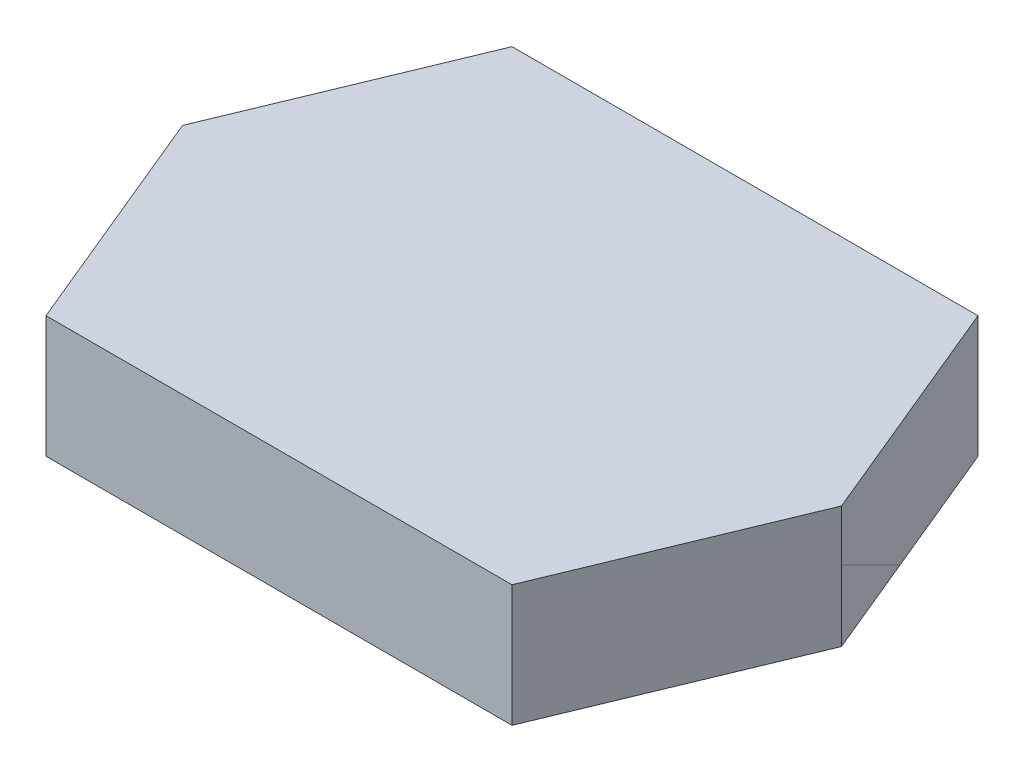
ISO-10303-21;
HEADER;
FILE_DESCRIPTION(('STEP AP214'),'2;1');
FILE_NAME('part.step','',(''),(''),'','','');
FILE_SCHEMA(('AUTOMOTIVE_DESIGN { 1 0 10303 214 1 1 1 1 }'));
ENDSEC;
DATA;
#1=APPLICATION_CONTEXT('core data for automotive mechanical design processes');
#2=APPLICATION_PROTOCOL_DEFINITION('international standard','automotive_design',2000,#1);
#3=PRODUCT_CONTEXT('',#1,'mechanical');
#4=PRODUCT('Part','Part','',(#3));
#5=PRODUCT_RELATED_PRODUCT_CATEGORY('part','',(#4));
#6=PRODUCT_DEFINITION_FORMATION('','',#4);
#7=PRODUCT_DEFINITION_CONTEXT('part definition',#1,'design');
#8=PRODUCT_DEFINITION('design','',#6,#7);
#9=PRODUCT_DEFINITION_SHAPE('','',#8);
#10=(LENGTH_UNIT() NAMED_UNIT(*) SI_UNIT(.MILLI.,.METRE.));
#11=(NAMED_UNIT(*) PLANE_ANGLE_UNIT() SI_UNIT($,.RADIAN.));
#12=(NAMED_UNIT(*) SI_UNIT($,.STERADIAN.) SOLID_ANGLE_UNIT());
#13=UNCERTAINTY_MEASURE_WITH_UNIT(LENGTH_MEASURE(1.E-05),#10,'distance_accuracy_value','');
#14=(GEOMETRIC_REPRESENTATION_CONTEXT(3) GLOBAL_UNCERTAINTY_ASSIGNED_CONTEXT((#13)) GLOBAL_UNIT_ASSIGNED_CONTEXT((#10,
#11,#12)) REPRESENTATION_CONTEXT('',''));
#15=CARTESIAN_POINT('',(0.,0.,0.));
#16=DIRECTION('',(0.,0.,1.));
#17=DIRECTION('',(1.,0.,0.));
#18=AXIS2_PLACEMENT_3D('',#15,#16,#17);
#19=CARTESIAN_POINT('',(19.1341716182545,10.,-19.1341716182545));
#20=DIRECTION('',(0.,0.,1.));
#21=DIRECTION('',(1.,0.,0.));
#22=AXIS2_PLACEMENT_3D('',#19,#20,#21);
#23=PLANE('',#22);
#24=DIRECTION('',(-1.,0.,0.));
#25=VECTOR('',#24,1.);
#26=CARTESIAN_POINT('',(19.1341716182545,0.,-19.1341716182545));
#27=LINE('',#26,#25);
#28=CARTESIAN_POINT('',(19.1341716182545,0.,-19.1341716182545));
#29=VERTEX_POINT('',#28);
#30=CARTESIAN_POINT('',(-19.1341716182545,0.,-19.1341716182545));
#31=VERTEX_POINT('',#30);
#32=EDGE_CURVE('E134',#29,#31,#27,.T.);
#33=ORIENTED_EDGE('',*,*,#32,.T.);
#34=DIRECTION('',(0.,-1.,0.));
#35=VECTOR('',#34,1.);
#36=CARTESIAN_POINT('',(-19.1341716182545,10.,-19.1341716182545));
#37=LINE('',#36,#35);
#38=CARTESIAN_POINT('',(-19.1341716182545,10.,-19.1341716182545));
#39=VERTEX_POINT('',#38);
#40=EDGE_CURVE('E12',#39,#31,#37,.T.);
#41=ORIENTED_EDGE('',*,*,#40,.F.);
#42=DIRECTION('',(-1.,0.,0.));
#43=VECTOR('',#42,1.);
#44=CARTESIAN_POINT('',(19.1341716182545,10.,-19.1341716182545));
#45=LINE('',#44,#43);
#46=CARTESIAN_POINT('',(19.1341716182545,10.,-19.1341716182545));
#47=VERTEX_POINT('',#46);
#48=EDGE_CURVE('E145',#47,#39,#45,.T.);
#49=ORIENTED_EDGE('',*,*,#48,.F.);
#50=DIRECTION('',(0.,-1.,0.));
#51=VECTOR('',#50,1.);
#52=CARTESIAN_POINT('',(19.1341716182545,10.,-19.1341716182545));
#53=LINE('',#52,#51);
#54=EDGE_CURVE('E130',#47,#29,#53,.T.);
#55=ORIENTED_EDGE('',*,*,#54,.T.);
#56=EDGE_LOOP('',(#33,#41,#49,#55));
#57=FACE_BOUND('',#56,.T.);
#58=ADVANCED_FACE('F49',(#57),#23,.F.);
#59=CARTESIAN_POINT('',(-19.1341716182545,10.,-19.1341716182545));
#60=DIRECTION('',(0.923879532511287,0.,0.38268343236509));
#61=DIRECTION('',(0.38268343236509,0.,-0.923879532511287));
#62=AXIS2_PLACEMENT_3D('',#59,#60,#61);
#63=PLANE('',#62);
#64=DIRECTION('',(-0.38268343236509,0.,0.923879532511286));
#65=VECTOR('',#64,1.);
#66=CARTESIAN_POINT('',(-19.1341716182545,0.,-19.1341716182545));
#67=LINE('',#66,#65);
#68=CARTESIAN_POINT('',(-27.0598050073098,0.,0.));
#69=VERTEX_POINT('',#68);
#70=EDGE_CURVE('E137',#31,#69,#67,.T.);
#71=ORIENTED_EDGE('',*,*,#70,.T.);
#72=DIRECTION('',(0.,-1.,0.));
#73=VECTOR('',#72,1.);
#74=CARTESIAN_POINT('',(-27.0598050073098,10.,0.));
#75=LINE('',#74,#73);
#76=CARTESIAN_POINT('',(-27.0598050073098,10.,0.));
#77=VERTEX_POINT('',#76);
#78=EDGE_CURVE('E57',#77,#69,#75,.T.);
#79=ORIENTED_EDGE('',*,*,#78,.F.);
#80=DIRECTION('',(-0.38268343236509,0.,0.923879532511286));
#81=VECTOR('',#80,1.);
#82=CARTESIAN_POINT('',(-19.1341716182545,10.,-19.1341716182545));
#83=LINE('',#82,#81);
#84=EDGE_CURVE('E99',#39,#77,#83,.T.);
#85=ORIENTED_EDGE('',*,*,#84,.F.);
#86=ORIENTED_EDGE('',*,*,#40,.T.);
#87=EDGE_LOOP('',(#71,#79,#85,#86));
#88=FACE_BOUND('',#87,.T.);
#89=ADVANCED_FACE('F154',(#88),#63,.F.);
#90=CARTESIAN_POINT('',(-27.0598050073098,10.,0.));
#91=DIRECTION('',(0.923879532511287,0.,-0.38268343236509));
#92=DIRECTION('',(-0.38268343236509,0.,-0.923879532511287));
#93=AXIS2_PLACEMENT_3D('',#90,#91,#92);
#94=PLANE('',#93);
#95=DIRECTION('',(0.38268343236509,0.,0.923879532511287));
#96=VECTOR('',#95,1.);
#97=CARTESIAN_POINT('',(-27.0598050073098,0.,0.));
#98=LINE('',#97,#96);
#99=CARTESIAN_POINT('',(-19.1341716182545,0.,19.1341716182545));
#100=VERTEX_POINT('',#99);
#101=EDGE_CURVE('E139',#69,#100,#98,.T.);
#102=ORIENTED_EDGE('',*,*,#101,.T.);
#103=DIRECTION('',(0.,-1.,0.));
#104=VECTOR('',#103,1.);
#105=CARTESIAN_POINT('',(-19.1341716182545,10.,19.1341716182545));
#106=LINE('',#105,#104);
#107=CARTESIAN_POINT('',(-19.1341716182545,10.,19.1341716182545));
#108=VERTEX_POINT('',#107);
#109=EDGE_CURVE('E125',#108,#100,#106,.T.);
#110=ORIENTED_EDGE('',*,*,#109,.F.);
#111=DIRECTION('',(0.38268343236509,0.,0.923879532511287));
#112=VECTOR('',#111,1.);
#113=CARTESIAN_POINT('',(-27.0598050073098,10.,0.));
#114=LINE('',#113,#112);
#115=EDGE_CURVE('E113',#77,#108,#114,.T.);
#116=ORIENTED_EDGE('',*,*,#115,.F.);
#117=ORIENTED_EDGE('',*,*,#78,.T.);
#118=EDGE_LOOP('',(#102,#110,#116,#117));
#119=FACE_BOUND('',#118,.T.);
#120=ADVANCED_FACE('F151',(#119),#94,.F.);
#121=CARTESIAN_POINT('',(-19.1341716182545,10.,19.1341716182545));
#122=DIRECTION('',(0.,0.,-1.));
#123=DIRECTION('',(-1.,0.,0.));
#124=AXIS2_PLACEMENT_3D('',#121,#122,#123);
#125=PLANE('',#124);
#126=DIRECTION('',(1.,0.,0.));
#127=VECTOR('',#126,1.);
#128=CARTESIAN_POINT('',(-19.1341716182545,0.,19.1341716182545));
#129=LINE('',#128,#127);
#130=CARTESIAN_POINT('',(19.1341716182545,0.,19.1341716182545));
#131=VERTEX_POINT('',#130);
#132=EDGE_CURVE('E122',#100,#131,#129,.T.);
#133=ORIENTED_EDGE('',*,*,#132,.T.);
#134=DIRECTION('',(0.,-1.,0.));
#135=VECTOR('',#134,1.);
#136=CARTESIAN_POINT('',(19.1341716182545,10.,19.1341716182545));
#137=LINE('',#136,#135);
#138=CARTESIAN_POINT('',(19.1341716182545,10.,19.1341716182545));
#139=VERTEX_POINT('',#138);
#140=EDGE_CURVE('E119',#139,#131,#137,.T.);
#141=ORIENTED_EDGE('',*,*,#140,.F.);
#142=DIRECTION('',(1.,0.,0.));
#143=VECTOR('',#142,1.);
#144=CARTESIAN_POINT('',(-19.1341716182545,10.,19.1341716182545));
#145=LINE('',#144,#143);
#146=EDGE_CURVE('E106',#108,#139,#145,.T.);
#147=ORIENTED_EDGE('',*,*,#146,.F.);
#148=ORIENTED_EDGE('',*,*,#109,.T.);
#149=EDGE_LOOP('',(#133,#141,#147,#148));
#150=FACE_BOUND('',#149,.T.);
#151=ADVANCED_FACE('F120',(#150),#125,.F.);
#152=CARTESIAN_POINT('',(19.1341716182545,10.,19.1341716182545));
#153=DIRECTION('',(-0.923879532511287,0.,-0.382683432365091));
#154=DIRECTION('',(-0.382683432365091,0.,0.923879532511287));
#155=AXIS2_PLACEMENT_3D('',#152,#153,#154);
#156=PLANE('',#155);
#157=DIRECTION('',(0.382683432365091,0.,-0.923879532511287));
#158=VECTOR('',#157,1.);
#159=CARTESIAN_POINT('',(19.1341716182545,0.,19.1341716182545));
#160=LINE('',#159,#158);
#161=CARTESIAN_POINT('',(27.0598050073099,0.,0.));
#162=VERTEX_POINT('',#161);
#163=EDGE_CURVE('E142',#131,#162,#160,.T.);
#164=ORIENTED_EDGE('',*,*,#163,.T.);
#165=DIRECTION('',(0.,-1.,0.));
#166=VECTOR('',#165,1.);
#167=CARTESIAN_POINT('',(27.0598050073099,10.,0.));
#168=LINE('',#167,#166);
#169=CARTESIAN_POINT('',(27.0598050073099,10.,0.));
#170=VERTEX_POINT('',#169);
#171=EDGE_CURVE('E126',#170,#162,#168,.T.);
#172=ORIENTED_EDGE('',*,*,#171,.F.);
#173=DIRECTION('',(0.382683432365091,0.,-0.923879532511287));
#174=VECTOR('',#173,1.);
#175=CARTESIAN_POINT('',(19.1341716182545,10.,19.1341716182545));
#176=LINE('',#175,#174);
#177=EDGE_CURVE('E110',#139,#170,#176,.T.);
#178=ORIENTED_EDGE('',*,*,#177,.F.);
#179=ORIENTED_EDGE('',*,*,#140,.T.);
#180=EDGE_LOOP('',(#164,#172,#178,#179));
#181=FACE_BOUND('',#180,.T.);
#182=ADVANCED_FACE('F128',(#181),#156,.F.);
#183=CARTESIAN_POINT('',(23.0969883127822,10.,-9.56708580912727));
#184=DIRECTION('',(-0.923879532511287,0.,0.382683432365091));
#185=DIRECTION('',(0.382683432365091,0.,0.923879532511287));
#186=AXIS2_PLACEMENT_3D('',#183,#184,#185);
#187=PLANE('',#186);
#188=DIRECTION('',(-0.382683432365091,0.,-0.923879532511286));
#189=VECTOR('',#188,1.);
#190=CARTESIAN_POINT('',(23.0969883127822,0.,-9.56708580912727));
#191=LINE('',#190,#189);
#192=EDGE_CURVE('E88',#162,#29,#191,.T.);
#193=ORIENTED_EDGE('',*,*,#192,.T.);
#194=ORIENTED_EDGE('',*,*,#54,.F.);
#195=DIRECTION('',(0.38268343236509,0.,0.923879532511286));
#196=VECTOR('',#195,1.);
#197=CARTESIAN_POINT('',(23.0969883127822,10.,-9.56708580912727));
#198=LINE('',#197,#196);
#199=EDGE_CURVE('E65',#47,#170,#198,.T.);
#200=ORIENTED_EDGE('',*,*,#199,.T.);
#201=ORIENTED_EDGE('',*,*,#171,.T.);
#202=EDGE_LOOP('',(#193,#194,#200,#201));
#203=FACE_BOUND('',#202,.T.);
#204=ADVANCED_FACE('F157',(#203),#187,.F.);
#205=CARTESIAN_POINT('',(0.,10.,0.));
#206=DIRECTION('',(0.,1.,0.));
#207=DIRECTION('',(0.,0.,1.));
#208=AXIS2_PLACEMENT_3D('',#205,#206,#207);
#209=PLANE('',#208);
#210=ORIENTED_EDGE('',*,*,#48,.T.);
#211=ORIENTED_EDGE('',*,*,#84,.T.);
#212=ORIENTED_EDGE('',*,*,#115,.T.);
#213=ORIENTED_EDGE('',*,*,#146,.T.);
#214=ORIENTED_EDGE('',*,*,#177,.T.);
#215=ORIENTED_EDGE('',*,*,#199,.F.);
#216=EDGE_LOOP('',(#210,#211,#212,#213,#214,#215));
#217=FACE_BOUND('',#216,.T.);
#218=ADVANCED_FACE('F108',(#217),#209,.T.);
#219=CARTESIAN_POINT('',(0.,0.,0.));
#220=DIRECTION('',(0.,1.,0.));
#221=DIRECTION('',(0.,0.,1.));
#222=AXIS2_PLACEMENT_3D('',#219,#220,#221);
#223=PLANE('',#222);
#224=ORIENTED_EDGE('',*,*,#32,.F.);
#225=ORIENTED_EDGE('',*,*,#192,.F.);
#226=ORIENTED_EDGE('',*,*,#163,.F.);
#227=ORIENTED_EDGE('',*,*,#132,.F.);
#228=ORIENTED_EDGE('',*,*,#101,.F.);
#229=ORIENTED_EDGE('',*,*,#70,.F.);
#230=EDGE_LOOP('',(#224,#225,#226,#227,#228,#229));
#231=FACE_BOUND('',#230,.T.);
#232=ADVANCED_FACE('F152',(#231),#223,.F.);
#233=CLOSED_SHELL('',(#58,#89,#120,#151,#182,#204,#218,#232));
#234=MANIFOLD_SOLID_BREP('B2',#233);
#235=CARTESIAN_POINT('',(19.1341716182545,10.,-19.1341716182545));
#236=DIRECTION('',(0.,0.,1.));
#237=DIRECTION('',(1.,0.,0.));
#238=AXIS2_PLACEMENT_3D('',#235,#236,#237);
#239=PLANE('',#238);
#240=DIRECTION('',(-1.,0.,0.));
#241=VECTOR('',#240,1.);
#242=CARTESIAN_POINT('',(19.1341716182545,0.,-19.1341716182545));
#243=LINE('',#242,#241);
#244=CARTESIAN_POINT('',(19.1341716182545,0.,-19.1341716182545));
#245=VERTEX_POINT('',#244);
#246=CARTESIAN_POINT('',(-19.1341716182545,0.,-19.1341716182545));
#247=VERTEX_POINT('',#246);
#248=EDGE_CURVE('E313',#245,#247,#243,.T.);
#249=ORIENTED_EDGE('',*,*,#248,.T.);
#250=DIRECTION('',(0.,-1.,0.));
#251=VECTOR('',#250,1.);
#252=CARTESIAN_POINT('',(-19.1341716182545,10.,-19.1341716182545));
#253=LINE('',#252,#251);
#254=CARTESIAN_POINT('',(-19.1341716182545,10.,-19.1341716182545));
#255=VERTEX_POINT('',#254);
#256=EDGE_CURVE('E47',#255,#247,#253,.T.);
#257=ORIENTED_EDGE('',*,*,#256,.F.);
#258=DIRECTION('',(-1.,0.,0.));
#259=VECTOR('',#258,1.);
#260=CARTESIAN_POINT('',(19.1341716182545,10.,-19.1341716182545));
#261=LINE('',#260,#259);
#262=CARTESIAN_POINT('',(19.1341716182545,10.,-19.1341716182545));
#263=VERTEX_POINT('',#262);
#264=EDGE_CURVE('E324',#263,#255,#261,.T.);
#265=ORIENTED_EDGE('',*,*,#264,.F.);
#266=DIRECTION('',(0.,-1.,0.));
#267=VECTOR('',#266,1.);
#268=CARTESIAN_POINT('',(19.1341716182545,10.,-19.1341716182545));
#269=LINE('',#268,#267);
#270=EDGE_CURVE('E309',#263,#245,#269,.T.);
#271=ORIENTED_EDGE('',*,*,#270,.T.);
#272=EDGE_LOOP('',(#249,#257,#265,#271));
#273=FACE_BOUND('',#272,.T.);
#274=ADVANCED_FACE('F228',(#273),#239,.F.);
#275=CARTESIAN_POINT('',(-19.1341716182545,10.,-19.1341716182545));
#276=DIRECTION('',(0.923879532511287,0.,0.38268343236509));
#277=DIRECTION('',(0.38268343236509,0.,-0.923879532511287));
#278=AXIS2_PLACEMENT_3D('',#275,#276,#277);
#279=PLANE('',#278);
#280=DIRECTION('',(-0.38268343236509,0.,0.923879532511286));
#281=VECTOR('',#280,1.);
#282=CARTESIAN_POINT('',(-19.1341716182545,0.,-19.1341716182545));
#283=LINE('',#282,#281);
#284=CARTESIAN_POINT('',(-27.0598050073098,0.,0.));
#285=VERTEX_POINT('',#284);
#286=EDGE_CURVE('E316',#247,#285,#283,.T.);
#287=ORIENTED_EDGE('',*,*,#286,.T.);
#288=DIRECTION('',(0.,-1.,0.));
#289=VECTOR('',#288,1.);
#290=CARTESIAN_POINT('',(-27.0598050073098,10.,0.));
#291=LINE('',#290,#289);
#292=CARTESIAN_POINT('',(-27.0598050073098,10.,0.));
#293=VERTEX_POINT('',#292);
#294=EDGE_CURVE('E236',#293,#285,#291,.T.);
#295=ORIENTED_EDGE('',*,*,#294,.F.);
#296=DIRECTION('',(-0.38268343236509,0.,0.923879532511286));
#297=VECTOR('',#296,1.);
#298=CARTESIAN_POINT('',(-19.1341716182545,10.,-19.1341716182545));
#299=LINE('',#298,#297);
#300=EDGE_CURVE('E278',#255,#293,#299,.T.);
#301=ORIENTED_EDGE('',*,*,#300,.F.);
#302=ORIENTED_EDGE('',*,*,#256,.T.);
#303=EDGE_LOOP('',(#287,#295,#301,#302));
#304=FACE_BOUND('',#303,.T.);
#305=ADVANCED_FACE('F333',(#304),#279,.F.);
#306=CARTESIAN_POINT('',(-27.0598050073098,10.,0.));
#307=DIRECTION('',(0.923879532511287,0.,-0.38268343236509));
#308=DIRECTION('',(-0.38268343236509,0.,-0.923879532511287));
#309=AXIS2_PLACEMENT_3D('',#306,#307,#308);
#310=PLANE('',#309);
#311=DIRECTION('',(0.38268343236509,0.,0.923879532511287));
#312=VECTOR('',#311,1.);
#313=CARTESIAN_POINT('',(-27.0598050073098,0.,0.));
#314=LINE('',#313,#312);
#315=CARTESIAN_POINT('',(-19.1341716182545,0.,19.1341716182545));
#316=VERTEX_POINT('',#315);
#317=EDGE_CURVE('E318',#285,#316,#314,.T.);
#318=ORIENTED_EDGE('',*,*,#317,.T.);
#319=DIRECTION('',(0.,-1.,0.));
#320=VECTOR('',#319,1.);
#321=CARTESIAN_POINT('',(-19.1341716182545,10.,19.1341716182545));
#322=LINE('',#321,#320);
#323=CARTESIAN_POINT('',(-19.1341716182545,10.,19.1341716182545));
#324=VERTEX_POINT('',#323);
#325=EDGE_CURVE('E304',#324,#316,#322,.T.);
#326=ORIENTED_EDGE('',*,*,#325,.F.);
#327=DIRECTION('',(0.38268343236509,0.,0.923879532511287));
#328=VECTOR('',#327,1.);
#329=CARTESIAN_POINT('',(-27.0598050073098,10.,0.));
#330=LINE('',#329,#328);
#331=EDGE_CURVE('E292',#293,#324,#330,.T.);
#332=ORIENTED_EDGE('',*,*,#331,.F.);
#333=ORIENTED_EDGE('',*,*,#294,.T.);
#334=EDGE_LOOP('',(#318,#326,#332,#333));
#335=FACE_BOUND('',#334,.T.);
#336=ADVANCED_FACE('F330',(#335),#310,.F.);
#337=CARTESIAN_POINT('',(-19.1341716182545,10.,19.1341716182545));
#338=DIRECTION('',(0.,0.,-1.));
#339=DIRECTION('',(-1.,0.,0.));
#340=AXIS2_PLACEMENT_3D('',#337,#338,#339);
#341=PLANE('',#340);
#342=DIRECTION('',(1.,0.,0.));
#343=VECTOR('',#342,1.);
#344=CARTESIAN_POINT('',(-19.1341716182545,0.,19.1341716182545));
#345=LINE('',#344,#343);
#346=CARTESIAN_POINT('',(19.1341716182545,0.,19.1341716182545));
#347=VERTEX_POINT('',#346);
#348=EDGE_CURVE('E301',#316,#347,#345,.T.);
#349=ORIENTED_EDGE('',*,*,#348,.T.);
#350=DIRECTION('',(0.,-1.,0.));
#351=VECTOR('',#350,1.);
#352=CARTESIAN_POINT('',(19.1341716182545,10.,19.1341716182545));
#353=LINE('',#352,#351);
#354=CARTESIAN_POINT('',(19.1341716182545,10.,19.1341716182545));
#355=VERTEX_POINT('',#354);
#356=EDGE_CURVE('E298',#355,#347,#353,.T.);
#357=ORIENTED_EDGE('',*,*,#356,.F.);
#358=DIRECTION('',(1.,0.,0.));
#359=VECTOR('',#358,1.);
#360=CARTESIAN_POINT('',(-19.1341716182545,10.,19.1341716182545));
#361=LINE('',#360,#359);
#362=EDGE_CURVE('E285',#324,#355,#361,.T.);
#363=ORIENTED_EDGE('',*,*,#362,.F.);
#364=ORIENTED_EDGE('',*,*,#325,.T.);
#365=EDGE_LOOP('',(#349,#357,#363,#364));
#366=FACE_BOUND('',#365,.T.);
#367=ADVANCED_FACE('F299',(#366),#341,.F.);
#368=CARTESIAN_POINT('',(19.1341716182545,10.,19.1341716182545));
#369=DIRECTION('',(-0.923879532511287,0.,-0.382683432365091));
#370=DIRECTION('',(-0.382683432365091,0.,0.923879532511287));
#371=AXIS2_PLACEMENT_3D('',#368,#369,#370);
#372=PLANE('',#371);
#373=DIRECTION('',(0.382683432365091,0.,-0.923879532511287));
#374=VECTOR('',#373,1.);
#375=CARTESIAN_POINT('',(19.1341716182545,0.,19.1341716182545));
#376=LINE('',#375,#374);
#377=CARTESIAN_POINT('',(27.0598050073099,0.,0.));
#378=VERTEX_POINT('',#377);
#379=EDGE_CURVE('E321',#347,#378,#376,.T.);
#380=ORIENTED_EDGE('',*,*,#379,.T.);
#381=DIRECTION('',(0.,-1.,0.));
#382=VECTOR('',#381,1.);
#383=CARTESIAN_POINT('',(27.0598050073099,10.,0.));
#384=LINE('',#383,#382);
#385=CARTESIAN_POINT('',(27.0598050073099,10.,0.));
#386=VERTEX_POINT('',#385);
#387=EDGE_CURVE('E305',#386,#378,#384,.T.);
#388=ORIENTED_EDGE('',*,*,#387,.F.);
#389=DIRECTION('',(0.382683432365091,0.,-0.923879532511287));
#390=VECTOR('',#389,1.);
#391=CARTESIAN_POINT('',(19.1341716182545,10.,19.1341716182545));
#392=LINE('',#391,#390);
#393=EDGE_CURVE('E289',#355,#386,#392,.T.);
#394=ORIENTED_EDGE('',*,*,#393,.F.);
#395=ORIENTED_EDGE('',*,*,#356,.T.);
#396=EDGE_LOOP('',(#380,#388,#394,#395));
#397=FACE_BOUND('',#396,.T.);
#398=ADVANCED_FACE('F307',(#397),#372,.F.);
#399=CARTESIAN_POINT('',(23.0969883127822,10.,-9.56708580912727));
#400=DIRECTION('',(-0.923879532511287,0.,0.382683432365091));
#401=DIRECTION('',(0.382683432365091,0.,0.923879532511287));
#402=AXIS2_PLACEMENT_3D('',#399,#400,#401);
#403=PLANE('',#402);
#404=DIRECTION('',(-0.382683432365091,0.,-0.923879532511286));
#405=VECTOR('',#404,1.);
#406=CARTESIAN_POINT('',(23.0969883127822,0.,-9.56708580912727));
#407=LINE('',#406,#405);
#408=EDGE_CURVE('E267',#378,#245,#407,.T.);
#409=ORIENTED_EDGE('',*,*,#408,.T.);
#410=ORIENTED_EDGE('',*,*,#270,.F.);
#411=DIRECTION('',(0.38268343236509,0.,0.923879532511286));
#412=VECTOR('',#411,1.);
#413=CARTESIAN_POINT('',(23.0969883127822,10.,-9.56708580912727));
#414=LINE('',#413,#412);
#415=EDGE_CURVE('E244',#263,#386,#414,.T.);
#416=ORIENTED_EDGE('',*,*,#415,.T.);
#417=ORIENTED_EDGE('',*,*,#387,.T.);
#418=EDGE_LOOP('',(#409,#410,#416,#417));
#419=FACE_BOUND('',#418,.T.);
#420=ADVANCED_FACE('F336',(#419),#403,.F.);
#421=CARTESIAN_POINT('',(0.,10.,0.));
#422=DIRECTION('',(0.,1.,0.));
#423=DIRECTION('',(0.,0.,1.));
#424=AXIS2_PLACEMENT_3D('',#421,#422,#423);
#425=PLANE('',#424);
#426=ORIENTED_EDGE('',*,*,#264,.T.);
#427=ORIENTED_EDGE('',*,*,#300,.T.);
#428=ORIENTED_EDGE('',*,*,#331,.T.);
#429=ORIENTED_EDGE('',*,*,#362,.T.);
#430=ORIENTED_EDGE('',*,*,#393,.T.);
#431=ORIENTED_EDGE('',*,*,#415,.F.);
#432=EDGE_LOOP('',(#426,#427,#428,#429,#430,#431));
#433=FACE_BOUND('',#432,.T.);
#434=ADVANCED_FACE('F287',(#433),#425,.T.);
#435=CARTESIAN_POINT('',(0.,0.,0.));
#436=DIRECTION('',(0.,1.,0.));
#437=DIRECTION('',(0.,0.,1.));
#438=AXIS2_PLACEMENT_3D('',#435,#436,#437);
#439=PLANE('',#438);
#440=ORIENTED_EDGE('',*,*,#248,.F.);
#441=ORIENTED_EDGE('',*,*,#408,.F.);
#442=ORIENTED_EDGE('',*,*,#379,.F.);
#443=ORIENTED_EDGE('',*,*,#348,.F.);
#444=ORIENTED_EDGE('',*,*,#317,.F.);
#445=ORIENTED_EDGE('',*,*,#286,.F.);
#446=EDGE_LOOP('',(#440,#441,#442,#443,#444,#445));
#447=FACE_BOUND('',#446,.T.);
#448=ADVANCED_FACE('F331',(#447),#439,.F.);
#449=CLOSED_SHELL('',(#274,#305,#336,#367,#398,#420,#434,#448));
#450=MANIFOLD_SOLID_BREP('B6',#449);
#451=ADVANCED_BREP_SHAPE_REPRESENTATION('',(#18,#234,#450),#14);
#452=SHAPE_DEFINITION_REPRESENTATION(#9,#451);
ENDSEC;
END-ISO-10303-21;
